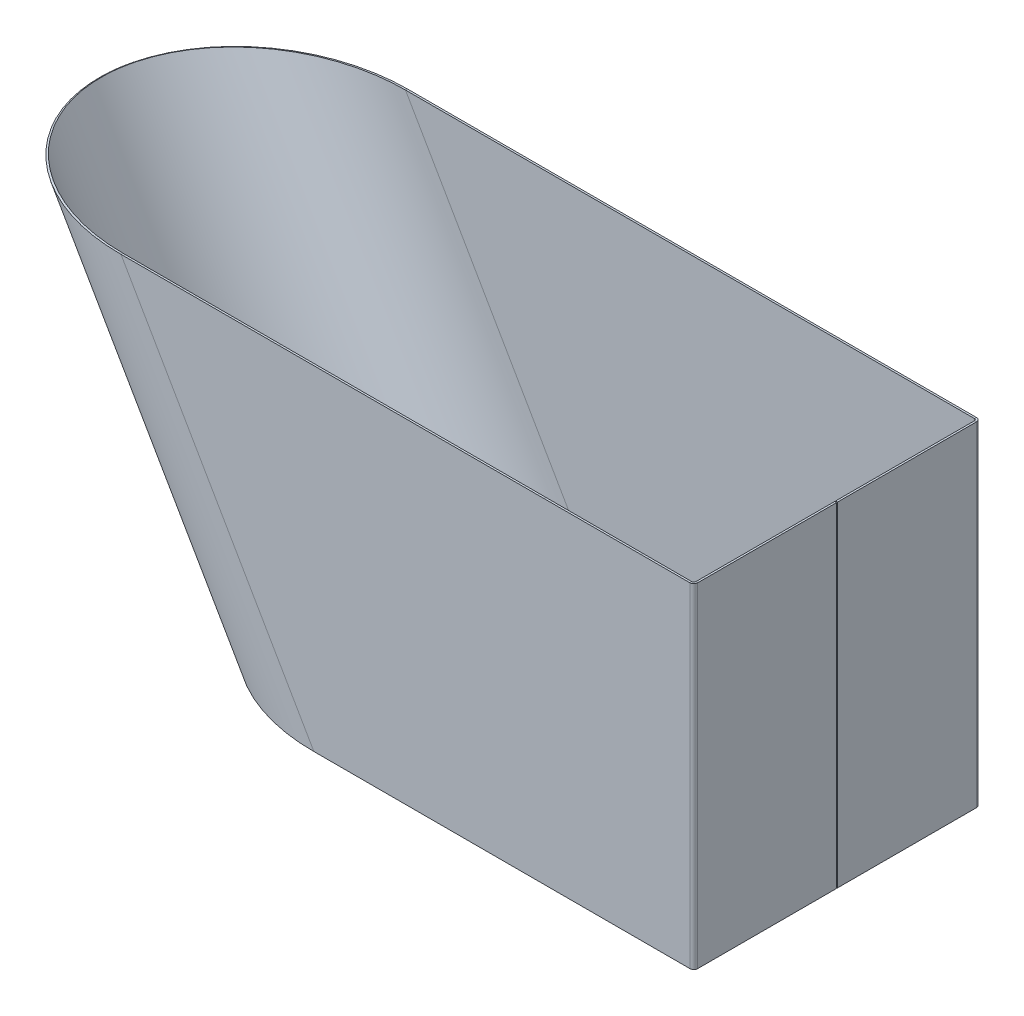
ISO-10303-21;
HEADER;
FILE_DESCRIPTION(('STEP AP214'),'2;1');
FILE_NAME('part.step','',(''),(''),'','','');
FILE_SCHEMA(('AUTOMOTIVE_DESIGN { 1 0 10303 214 1 1 1 1 }'));
ENDSEC;
DATA;
#1=APPLICATION_CONTEXT('core data for automotive mechanical design processes');
#2=APPLICATION_PROTOCOL_DEFINITION('international standard','automotive_design',2000,#1);
#3=PRODUCT_CONTEXT('',#1,'mechanical');
#4=PRODUCT('Part','Part','',(#3));
#5=PRODUCT_RELATED_PRODUCT_CATEGORY('part','',(#4));
#6=PRODUCT_DEFINITION_FORMATION('','',#4);
#7=PRODUCT_DEFINITION_CONTEXT('part definition',#1,'design');
#8=PRODUCT_DEFINITION('design','',#6,#7);
#9=PRODUCT_DEFINITION_SHAPE('','',#8);
#10=(LENGTH_UNIT() NAMED_UNIT(*) SI_UNIT(.MILLI.,.METRE.));
#11=(NAMED_UNIT(*) PLANE_ANGLE_UNIT() SI_UNIT($,.RADIAN.));
#12=(NAMED_UNIT(*) SI_UNIT($,.STERADIAN.) SOLID_ANGLE_UNIT());
#13=UNCERTAINTY_MEASURE_WITH_UNIT(LENGTH_MEASURE(1.E-05),#10,'distance_accuracy_value','');
#14=(GEOMETRIC_REPRESENTATION_CONTEXT(3) GLOBAL_UNCERTAINTY_ASSIGNED_CONTEXT((#13)) GLOBAL_UNIT_ASSIGNED_CONTEXT((#10,
#11,#12)) REPRESENTATION_CONTEXT('',''));
#15=CARTESIAN_POINT('',(0.,0.,0.));
#16=DIRECTION('',(0.,0.,1.));
#17=DIRECTION('',(1.,0.,0.));
#18=AXIS2_PLACEMENT_3D('',#15,#16,#17);
#19=CARTESIAN_POINT('',(397.927405783632,0.,148.));
#20=DIRECTION('',(0.,-1.,0.));
#21=DIRECTION('',(1.,0.,0.));
#22=AXIS2_PLACEMENT_3D('',#19,#20,#21);
#23=PLANE('',#22);
#24=DIRECTION('',(0.,0.,-1.));
#25=VECTOR('',#24,1.);
#26=CARTESIAN_POINT('',(393.927405783632,0.,148.));
#27=LINE('',#26,#25);
#28=CARTESIAN_POINT('',(393.927405783632,0.,150.));
#29=VERTEX_POINT('',#28);
#30=CARTESIAN_POINT('',(393.927405783632,0.,148.));
#31=VERTEX_POINT('',#30);
#32=EDGE_CURVE('E11',#29,#31,#27,.T.);
#33=ORIENTED_EDGE('',*,*,#32,.F.);
#34=DIRECTION('',(1.,0.,0.));
#35=VECTOR('',#34,1.);
#36=CARTESIAN_POINT('',(0.,0.,150.));
#37=LINE('',#36,#35);
#38=CARTESIAN_POINT('',(0.,0.,150.));
#39=VERTEX_POINT('',#38);
#40=EDGE_CURVE('E117',#39,#29,#37,.T.);
#41=ORIENTED_EDGE('',*,*,#40,.F.);
#42=DIRECTION('',(0.,0.,-1.));
#43=VECTOR('',#42,1.);
#44=CARTESIAN_POINT('',(0.,0.,148.));
#45=LINE('',#44,#43);
#46=CARTESIAN_POINT('',(0.,0.,148.));
#47=VERTEX_POINT('',#46);
#48=EDGE_CURVE('E53',#39,#47,#45,.T.);
#49=ORIENTED_EDGE('',*,*,#48,.T.);
#50=DIRECTION('',(1.,0.,0.));
#51=VECTOR('',#50,1.);
#52=CARTESIAN_POINT('',(397.927405783632,0.,148.));
#53=LINE('',#52,#51);
#54=EDGE_CURVE('E120',#47,#31,#53,.T.);
#55=ORIENTED_EDGE('',*,*,#54,.T.);
#56=EDGE_LOOP('',(#33,#41,#49,#55));
#57=FACE_BOUND('',#56,.T.);
#58=ADVANCED_FACE('F43',(#57),#23,.T.);
#59=CARTESIAN_POINT('',(-172.627730487698,-0.999999999999973,0.));
#60=CARTESIAN_POINT('',(-172.050380218508,-0.66666666666664,0.));
#61=CARTESIAN_POINT('',(-171.473029949319,-0.333333333333306,0.));
#62=CARTESIAN_POINT('',(-170.895679680129,0.,0.));
#63=CARTESIAN_POINT('',(-172.627730487698,-0.999999999999973,-300.));
#64=CARTESIAN_POINT('',(-172.050380218508,-0.66666666666664,-298.666666666667));
#65=CARTESIAN_POINT('',(-171.473029949319,-0.333333333333306,-297.333333333333));
#66=CARTESIAN_POINT('',(-170.895679680129,0.,-296.));
#67=CARTESIAN_POINT('',(172.627730487698,1.00000000000008,-300.));
#68=CARTESIAN_POINT('',(172.050380218508,0.666666666666751,-298.666666666667));
#69=CARTESIAN_POINT('',(171.473029949319,0.333333333333417,-297.333333333333));
#70=CARTESIAN_POINT('',(170.895679680129,0.,-296.));
#71=CARTESIAN_POINT('',(172.627730487698,1.00000000000008,0.));
#72=CARTESIAN_POINT('',(172.050380218508,0.666666666666751,0.));
#73=CARTESIAN_POINT('',(171.473029949319,0.333333333333417,0.));
#74=CARTESIAN_POINT('',(170.895679680129,0.,0.));
#75=CARTESIAN_POINT('',(172.627730487698,1.00000000000008,300.));
#76=CARTESIAN_POINT('',(172.050380218508,0.666666666666751,298.666666666667));
#77=CARTESIAN_POINT('',(171.473029949319,0.333333333333417,297.333333333333));
#78=CARTESIAN_POINT('',(170.895679680129,0.,296.));
#79=CARTESIAN_POINT('',(-172.627730487698,-0.999999999999973,300.));
#80=CARTESIAN_POINT('',(-172.050380218508,-0.66666666666664,298.666666666667));
#81=CARTESIAN_POINT('',(-171.473029949319,-0.333333333333306,297.333333333333));
#82=CARTESIAN_POINT('',(-170.895679680129,0.,296.));
#83=CARTESIAN_POINT('',(-172.627730487698,-0.999999999999973,0.));
#84=CARTESIAN_POINT('',(-172.050380218508,-0.66666666666664,0.));
#85=CARTESIAN_POINT('',(-171.473029949319,-0.333333333333306,0.));
#86=CARTESIAN_POINT('',(-170.895679680129,0.,0.));
#87=(BOUNDED_SURFACE() B_SPLINE_SURFACE(3,3,((#59,#60,#61,#62),(#63,#64,#65,#66),(#67,#68,#69,
#70),(#71,#72,#73,#74),(#75,#76,#77,#78),(#79,#80,#81,#82),(#83,#84,#85,#86)),.UNSPECIFIED.,.T.,
.F.,.F.) B_SPLINE_SURFACE_WITH_KNOTS((4,3,4),(4,4),(0.,0.5,1.),(0.,1.),
.UNSPECIFIED.) GEOMETRIC_REPRESENTATION_ITEM() RATIONAL_B_SPLINE_SURFACE(((1.,1.,1.,1.),
(0.333333333333333,0.333333333333333,0.333333333333333,0.333333333333333),(0.333333333333333,
0.333333333333333,0.333333333333333,0.333333333333333),(1.,1.,1.,1.),(0.333333333333333,
0.333333333333333,0.333333333333333,0.333333333333333),(0.333333333333333,0.333333333333333,
0.333333333333333,0.333333333333333),(1.,1.,1.,1.))) REPRESENTATION_ITEM('') SURFACE());
#88=CARTESIAN_POINT('',(0.,0.,0.));
#89=DIRECTION('',(-0.00579271487414784,0.999983222086444,0.));
#90=DIRECTION('',(-0.999983222086444,-0.00579271487414784,0.));
#91=AXIS2_PLACEMENT_3D('',#88,#89,#90);
#92=ELLIPSE('',#91,172.630626869433,150.);
#93=CARTESIAN_POINT('',(0.,0.,-150.));
#94=VERTEX_POINT('',#93);
#95=EDGE_CURVE('E283',#39,#94,#92,.F.);
#96=DIRECTION('',(0.,0.,1.));
#97=VECTOR('',#96,1.);
#98=CARTESIAN_POINT('',(-1.11022302462516E-13,0.,-148.));
#99=LINE('',#98,#97);
#100=CARTESIAN_POINT('',(-1.11022302462516E-13,0.,-148.));
#101=VERTEX_POINT('',#100);
#102=EDGE_CURVE('E195',#94,#101,#99,.T.);
#103=CARTESIAN_POINT('',(0.,0.,0.));
#104=DIRECTION('',(0.,1.,0.));
#105=DIRECTION('',(-1.,0.,0.));
#106=AXIS2_PLACEMENT_3D('',#103,#104,#105);
#107=ELLIPSE('',#106,170.895679680129,148.);
#108=EDGE_CURVE('E216',#47,#101,#107,.F.);
#109=ORIENTED_EDGE('',*,*,#48,.F.);
#110=ORIENTED_EDGE('',*,*,#95,.T.);
#111=ORIENTED_EDGE('',*,*,#102,.T.);
#112=ORIENTED_EDGE('',*,*,#108,.F.);
#113=EDGE_LOOP('',(#109,#110,#111,#112));
#114=FACE_BOUND('',#113,.T.);
#115=ADVANCED_FACE('F217',(#114),#87,.T.);
#116=CARTESIAN_POINT('',(397.927405783632,0.,-148.));
#117=DIRECTION('',(0.,-1.,0.));
#118=DIRECTION('',(1.,0.,0.));
#119=AXIS2_PLACEMENT_3D('',#116,#117,#118);
#120=PLANE('',#119);
#121=ORIENTED_EDGE('',*,*,#102,.F.);
#122=DIRECTION('',(1.,0.,0.));
#123=VECTOR('',#122,1.);
#124=CARTESIAN_POINT('',(0.,0.,-150.));
#125=LINE('',#124,#123);
#126=CARTESIAN_POINT('',(393.927405783632,0.,-150.));
#127=VERTEX_POINT('',#126);
#128=EDGE_CURVE('E153',#94,#127,#125,.T.);
#129=ORIENTED_EDGE('',*,*,#128,.T.);
#130=DIRECTION('',(0.,0.,1.));
#131=VECTOR('',#130,1.);
#132=CARTESIAN_POINT('',(393.927405783632,0.,-148.));
#133=LINE('',#132,#131);
#134=CARTESIAN_POINT('',(393.927405783632,0.,-148.));
#135=VERTEX_POINT('',#134);
#136=EDGE_CURVE('E192',#127,#135,#133,.T.);
#137=ORIENTED_EDGE('',*,*,#136,.T.);
#138=DIRECTION('',(1.,0.,0.));
#139=VECTOR('',#138,1.);
#140=CARTESIAN_POINT('',(397.927405783632,0.,-148.));
#141=LINE('',#140,#139);
#142=EDGE_CURVE('E250',#101,#135,#141,.T.);
#143=ORIENTED_EDGE('',*,*,#142,.F.);
#144=EDGE_LOOP('',(#121,#129,#137,#143));
#145=FACE_BOUND('',#144,.T.);
#146=ADVANCED_FACE('F309',(#145),#120,.T.);
#147=CARTESIAN_POINT('',(393.927405783632,0.,-146.));
#148=DIRECTION('',(0.,1.,0.));
#149=DIRECTION('',(-1.,0.,0.));
#150=AXIS2_PLACEMENT_3D('',#147,#148,#149);
#151=PLANE('',#150);
#152=ORIENTED_EDGE('',*,*,#136,.F.);
#153=CARTESIAN_POINT('',(393.927405783632,0.,-146.));
#154=DIRECTION('',(0.,-1.,0.));
#155=DIRECTION('',(1.,0.,0.));
#156=AXIS2_PLACEMENT_3D('',#153,#154,#155);
#157=CIRCLE('',#156,4.);
#158=CARTESIAN_POINT('',(397.927405783632,0.,-146.));
#159=VERTEX_POINT('',#158);
#160=EDGE_CURVE('E158',#127,#159,#157,.T.);
#161=ORIENTED_EDGE('',*,*,#160,.T.);
#162=DIRECTION('',(-1.,0.,0.));
#163=VECTOR('',#162,1.);
#164=CARTESIAN_POINT('',(395.927405783632,0.,-146.));
#165=LINE('',#164,#163);
#166=CARTESIAN_POINT('',(395.927405783632,0.,-146.));
#167=VERTEX_POINT('',#166);
#168=EDGE_CURVE('E61',#159,#167,#165,.T.);
#169=ORIENTED_EDGE('',*,*,#168,.T.);
#170=CARTESIAN_POINT('',(393.927405783632,0.,-146.));
#171=DIRECTION('',(0.,-1.,0.));
#172=DIRECTION('',(1.,0.,0.));
#173=AXIS2_PLACEMENT_3D('',#170,#171,#172);
#174=CIRCLE('',#173,2.);
#175=EDGE_CURVE('E248',#135,#167,#174,.T.);
#176=ORIENTED_EDGE('',*,*,#175,.F.);
#177=EDGE_LOOP('',(#152,#161,#169,#176));
#178=FACE_BOUND('',#177,.T.);
#179=ADVANCED_FACE('F402',(#178),#151,.F.);
#180=CARTESIAN_POINT('',(395.927405783632,0.,150.));
#181=DIRECTION('',(0.,1.,0.));
#182=DIRECTION('',(0.,0.,-1.));
#183=AXIS2_PLACEMENT_3D('',#180,#181,#182);
#184=PLANE('',#183);
#185=ORIENTED_EDGE('',*,*,#168,.F.);
#186=DIRECTION('',(0.,0.,1.));
#187=VECTOR('',#186,1.);
#188=CARTESIAN_POINT('',(397.927405783632,4.44089209850063E-13,150.));
#189=LINE('',#188,#187);
#190=CARTESIAN_POINT('',(397.927405783632,4.44089209850063E-13,-0.5));
#191=VERTEX_POINT('',#190);
#192=EDGE_CURVE('E148',#191,#159,#189,.F.);
#193=ORIENTED_EDGE('',*,*,#192,.F.);
#194=DIRECTION('',(-1.,0.,0.));
#195=VECTOR('',#194,1.);
#196=CARTESIAN_POINT('',(395.927405783632,4.4679465673982E-13,-0.499999999999994));
#197=LINE('',#196,#195);
#198=CARTESIAN_POINT('',(395.927405783632,4.4679465673982E-13,-0.499999999999994));
#199=VERTEX_POINT('',#198);
#200=EDGE_CURVE('E188',#191,#199,#197,.T.);
#201=ORIENTED_EDGE('',*,*,#200,.T.);
#202=DIRECTION('',(0.,0.,-1.));
#203=VECTOR('',#202,1.);
#204=CARTESIAN_POINT('',(395.927405783632,0.,150.));
#205=LINE('',#204,#203);
#206=EDGE_CURVE('E213',#199,#167,#205,.T.);
#207=ORIENTED_EDGE('',*,*,#206,.T.);
#208=EDGE_LOOP('',(#185,#193,#201,#207));
#209=FACE_BOUND('',#208,.T.);
#210=ADVANCED_FACE('F405',(#209),#184,.F.);
#211=CARTESIAN_POINT('',(395.927405783632,4.4679465673982E-13,-0.499999999999994));
#212=DIRECTION('',(0.,0.,1.));
#213=DIRECTION('',(0.,1.,0.));
#214=AXIS2_PLACEMENT_3D('',#211,#212,#213);
#215=PLANE('',#214);
#216=ORIENTED_EDGE('',*,*,#200,.F.);
#217=DIRECTION('',(0.,-1.,0.));
#218=VECTOR('',#217,1.);
#219=CARTESIAN_POINT('',(397.927405783632,350.,-0.5));
#220=LINE('',#219,#218);
#221=CARTESIAN_POINT('',(397.927405783632,350.,-0.5));
#222=VERTEX_POINT('',#221);
#223=EDGE_CURVE('E268',#191,#222,#220,.F.);
#224=ORIENTED_EDGE('',*,*,#223,.T.);
#225=DIRECTION('',(-1.,0.,0.));
#226=VECTOR('',#225,1.);
#227=CARTESIAN_POINT('',(395.927405783632,350.,-0.5));
#228=LINE('',#227,#226);
#229=CARTESIAN_POINT('',(395.927405783632,350.,-0.5));
#230=VERTEX_POINT('',#229);
#231=EDGE_CURVE('E185',#222,#230,#228,.T.);
#232=ORIENTED_EDGE('',*,*,#231,.T.);
#233=DIRECTION('',(0.,1.,0.));
#234=VECTOR('',#233,1.);
#235=CARTESIAN_POINT('',(395.927405783632,4.4679465673982E-13,-0.499999999999994));
#236=LINE('',#235,#234);
#237=EDGE_CURVE('E322',#199,#230,#236,.T.);
#238=ORIENTED_EDGE('',*,*,#237,.F.);
#239=EDGE_LOOP('',(#216,#224,#232,#238));
#240=FACE_BOUND('',#239,.T.);
#241=ADVANCED_FACE('F406',(#240),#215,.T.);
#242=CARTESIAN_POINT('',(395.927405783632,350.,150.));
#243=DIRECTION('',(0.,1.,0.));
#244=DIRECTION('',(0.,0.,-1.));
#245=AXIS2_PLACEMENT_3D('',#242,#243,#244);
#246=PLANE('',#245);
#247=ORIENTED_EDGE('',*,*,#231,.F.);
#248=DIRECTION('',(0.,0.,1.));
#249=VECTOR('',#248,1.);
#250=CARTESIAN_POINT('',(397.927405783632,350.,150.));
#251=LINE('',#250,#249);
#252=CARTESIAN_POINT('',(397.927405783632,350.,-146.));
#253=VERTEX_POINT('',#252);
#254=EDGE_CURVE('E291',#222,#253,#251,.F.);
#255=ORIENTED_EDGE('',*,*,#254,.T.);
#256=DIRECTION('',(-1.,0.,0.));
#257=VECTOR('',#256,1.);
#258=CARTESIAN_POINT('',(395.927405783632,350.,-146.));
#259=LINE('',#258,#257);
#260=CARTESIAN_POINT('',(395.927405783632,350.,-146.));
#261=VERTEX_POINT('',#260);
#262=EDGE_CURVE('E183',#253,#261,#259,.T.);
#263=ORIENTED_EDGE('',*,*,#262,.T.);
#264=DIRECTION('',(0.,0.,-1.));
#265=VECTOR('',#264,1.);
#266=CARTESIAN_POINT('',(395.927405783632,350.,150.));
#267=LINE('',#266,#265);
#268=EDGE_CURVE('E325',#230,#261,#267,.T.);
#269=ORIENTED_EDGE('',*,*,#268,.F.);
#270=EDGE_LOOP('',(#247,#255,#263,#269));
#271=FACE_BOUND('',#270,.T.);
#272=ADVANCED_FACE('F409',(#271),#246,.T.);
#273=CARTESIAN_POINT('',(393.927405783632,350.,-146.));
#274=DIRECTION('',(0.,1.,0.));
#275=DIRECTION('',(0.,0.,1.));
#276=AXIS2_PLACEMENT_3D('',#273,#274,#275);
#277=PLANE('',#276);
#278=ORIENTED_EDGE('',*,*,#262,.F.);
#279=CARTESIAN_POINT('',(393.927405783632,350.,-146.));
#280=DIRECTION('',(0.,-1.,0.));
#281=DIRECTION('',(1.,0.,0.));
#282=AXIS2_PLACEMENT_3D('',#279,#280,#281);
#283=CIRCLE('',#282,4.);
#284=CARTESIAN_POINT('',(393.927405783632,350.,-150.));
#285=VERTEX_POINT('',#284);
#286=EDGE_CURVE('E288',#253,#285,#283,.F.);
#287=ORIENTED_EDGE('',*,*,#286,.T.);
#288=DIRECTION('',(0.,0.,1.));
#289=VECTOR('',#288,1.);
#290=CARTESIAN_POINT('',(393.927405783632,350.,-148.));
#291=LINE('',#290,#289);
#292=CARTESIAN_POINT('',(393.927405783632,350.,-148.));
#293=VERTEX_POINT('',#292);
#294=EDGE_CURVE('E180',#285,#293,#291,.T.);
#295=ORIENTED_EDGE('',*,*,#294,.T.);
#296=CARTESIAN_POINT('',(393.927405783632,350.,-146.));
#297=DIRECTION('',(0.,-1.,0.));
#298=DIRECTION('',(0.,0.,-1.));
#299=AXIS2_PLACEMENT_3D('',#296,#297,#298);
#300=CIRCLE('',#299,2.);
#301=EDGE_CURVE('E256',#261,#293,#300,.F.);
#302=ORIENTED_EDGE('',*,*,#301,.F.);
#303=EDGE_LOOP('',(#278,#287,#295,#302));
#304=FACE_BOUND('',#303,.T.);
#305=ADVANCED_FACE('F359',(#304),#277,.T.);
#306=CARTESIAN_POINT('',(-202.072594216368,350.,-148.));
#307=DIRECTION('',(0.,1.,0.));
#308=DIRECTION('',(-1.,0.,0.));
#309=AXIS2_PLACEMENT_3D('',#306,#307,#308);
#310=PLANE('',#309);
#311=ORIENTED_EDGE('',*,*,#294,.F.);
#312=DIRECTION('',(1.,0.,0.));
#313=VECTOR('',#312,1.);
#314=CARTESIAN_POINT('',(0.,350.,-150.));
#315=LINE('',#314,#313);
#316=CARTESIAN_POINT('',(-202.072594216368,350.,-150.));
#317=VERTEX_POINT('',#316);
#318=EDGE_CURVE('E156',#285,#317,#315,.F.);
#319=ORIENTED_EDGE('',*,*,#318,.T.);
#320=DIRECTION('',(0.,0.,1.));
#321=VECTOR('',#320,1.);
#322=CARTESIAN_POINT('',(-202.072594216368,350.,-148.));
#323=LINE('',#322,#321);
#324=CARTESIAN_POINT('',(-202.072594216368,350.,-148.));
#325=VERTEX_POINT('',#324);
#326=EDGE_CURVE('E177',#317,#325,#323,.T.);
#327=ORIENTED_EDGE('',*,*,#326,.T.);
#328=DIRECTION('',(-1.,0.,0.));
#329=VECTOR('',#328,1.);
#330=CARTESIAN_POINT('',(-202.072594216368,350.,-148.));
#331=LINE('',#330,#329);
#332=EDGE_CURVE('E316',#293,#325,#331,.T.);
#333=ORIENTED_EDGE('',*,*,#332,.F.);
#334=EDGE_LOOP('',(#311,#319,#327,#333));
#335=FACE_BOUND('',#334,.T.);
#336=ADVANCED_FACE('F366',(#335),#310,.T.);
#337=CARTESIAN_POINT('',(-372.968273896497,350.,0.));
#338=CARTESIAN_POINT('',(-373.545624165687,349.666666666667,0.));
#339=CARTESIAN_POINT('',(-374.122974434876,349.333333333333,0.));
#340=CARTESIAN_POINT('',(-374.700324704066,349.,0.));
#341=CARTESIAN_POINT('',(-372.968273896497,350.,-296.));
#342=CARTESIAN_POINT('',(-373.545624165687,349.666666666667,-297.333333333333));
#343=CARTESIAN_POINT('',(-374.122974434876,349.333333333333,-298.666666666667));
#344=CARTESIAN_POINT('',(-374.700324704066,349.,-300.));
#345=CARTESIAN_POINT('',(-31.1769145362391,350.,-296.));
#346=CARTESIAN_POINT('',(-30.5995642670495,350.333333333333,-297.333333333333));
#347=CARTESIAN_POINT('',(-30.0222139978599,350.666666666667,-298.666666666667));
#348=CARTESIAN_POINT('',(-29.4448637286702,351.,-300.));
#349=CARTESIAN_POINT('',(-31.1769145362391,350.,0.));
#350=CARTESIAN_POINT('',(-30.5995642670494,350.333333333333,0.));
#351=CARTESIAN_POINT('',(-30.0222139978598,350.666666666667,0.));
#352=CARTESIAN_POINT('',(-29.4448637286702,351.,0.));
#353=CARTESIAN_POINT('',(-31.176914536239,350.,296.));
#354=CARTESIAN_POINT('',(-30.5995642670494,350.333333333333,297.333333333333));
#355=CARTESIAN_POINT('',(-30.0222139978598,350.666666666667,298.666666666667));
#356=CARTESIAN_POINT('',(-29.4448637286701,351.,300.));
#357=CARTESIAN_POINT('',(-372.968273896497,350.,296.));
#358=CARTESIAN_POINT('',(-373.545624165687,349.666666666667,297.333333333333));
#359=CARTESIAN_POINT('',(-374.122974434876,349.333333333333,298.666666666667));
#360=CARTESIAN_POINT('',(-374.700324704066,349.,300.));
#361=CARTESIAN_POINT('',(-372.968273896497,350.,0.));
#362=CARTESIAN_POINT('',(-373.545624165687,349.666666666667,0.));
#363=CARTESIAN_POINT('',(-374.122974434876,349.333333333333,0.));
#364=CARTESIAN_POINT('',(-374.700324704066,349.,0.));
#365=(BOUNDED_SURFACE() B_SPLINE_SURFACE(3,3,((#337,#338,#339,#340),(#341,#342,#343,#344),(#345,
#346,#347,#348),(#349,#350,#351,#352),(#353,#354,#355,#356),(#357,#358,#359,#360),(#361,#362,
#363,#364)),.UNSPECIFIED.,.T.,.F.,.F.) B_SPLINE_SURFACE_WITH_KNOTS((4,3,4),(4,4),(0.,0.5,1.),
(0.,1.),.UNSPECIFIED.) GEOMETRIC_REPRESENTATION_ITEM() RATIONAL_B_SPLINE_SURFACE(((1.,1.,1.,1.),
(0.333333333333333,0.333333333333333,0.333333333333333,0.333333333333333),(0.333333333333333,
0.333333333333333,0.333333333333333,0.333333333333333),(1.,1.,1.,1.),(0.333333333333333,
0.333333333333333,0.333333333333333,0.333333333333333),(0.333333333333333,0.333333333333333,
0.333333333333333,0.333333333333333),(1.,1.,1.,1.))) REPRESENTATION_ITEM('') SURFACE());
#366=CARTESIAN_POINT('',(-202.072594216368,350.,0.));
#367=DIRECTION('',(0.00579271487414768,-0.999983222086444,0.));
#368=DIRECTION('',(-0.999983222086444,-0.00579271487414768,0.));
#369=AXIS2_PLACEMENT_3D('',#366,#367,#368);
#370=ELLIPSE('',#369,172.630626869433,150.);
#371=CARTESIAN_POINT('',(-202.072594216368,350.,150.));
#372=VERTEX_POINT('',#371);
#373=EDGE_CURVE('E279',#372,#317,#370,.T.);
#374=DIRECTION('',(0.,0.,-1.));
#375=VECTOR('',#374,1.);
#376=CARTESIAN_POINT('',(-202.072594216368,350.,148.));
#377=LINE('',#376,#375);
#378=CARTESIAN_POINT('',(-202.072594216368,350.,148.));
#379=VERTEX_POINT('',#378);
#380=EDGE_CURVE('E174',#372,#379,#377,.T.);
#381=CARTESIAN_POINT('',(-202.072594216368,350.,0.));
#382=DIRECTION('',(0.,-1.,0.));
#383=DIRECTION('',(-1.,0.,0.));
#384=AXIS2_PLACEMENT_3D('',#381,#382,#383);
#385=ELLIPSE('',#384,170.895679680129,148.);
#386=EDGE_CURVE('E222',#379,#325,#385,.T.);
#387=ORIENTED_EDGE('',*,*,#326,.F.);
#388=ORIENTED_EDGE('',*,*,#373,.F.);
#389=ORIENTED_EDGE('',*,*,#380,.T.);
#390=ORIENTED_EDGE('',*,*,#386,.T.);
#391=EDGE_LOOP('',(#387,#388,#389,#390));
#392=FACE_BOUND('',#391,.T.);
#393=ADVANCED_FACE('F369',(#392),#365,.T.);
#394=CARTESIAN_POINT('',(-202.072594216368,350.,148.));
#395=DIRECTION('',(0.,1.,0.));
#396=DIRECTION('',(-1.,0.,0.));
#397=AXIS2_PLACEMENT_3D('',#394,#395,#396);
#398=PLANE('',#397);
#399=ORIENTED_EDGE('',*,*,#380,.F.);
#400=DIRECTION('',(1.,0.,0.));
#401=VECTOR('',#400,1.);
#402=CARTESIAN_POINT('',(0.,350.,150.));
#403=LINE('',#402,#401);
#404=CARTESIAN_POINT('',(393.927405783632,350.,150.));
#405=VERTEX_POINT('',#404);
#406=EDGE_CURVE('E264',#405,#372,#403,.F.);
#407=ORIENTED_EDGE('',*,*,#406,.F.);
#408=DIRECTION('',(0.,0.,-1.));
#409=VECTOR('',#408,1.);
#410=CARTESIAN_POINT('',(393.927405783632,350.,148.));
#411=LINE('',#410,#409);
#412=CARTESIAN_POINT('',(393.927405783632,350.,148.));
#413=VERTEX_POINT('',#412);
#414=EDGE_CURVE('E171',#405,#413,#411,.T.);
#415=ORIENTED_EDGE('',*,*,#414,.T.);
#416=DIRECTION('',(-1.,0.,0.));
#417=VECTOR('',#416,1.);
#418=CARTESIAN_POINT('',(-202.072594216368,350.,148.));
#419=LINE('',#418,#417);
#420=EDGE_CURVE('E223',#413,#379,#419,.T.);
#421=ORIENTED_EDGE('',*,*,#420,.T.);
#422=EDGE_LOOP('',(#399,#407,#415,#421));
#423=FACE_BOUND('',#422,.T.);
#424=ADVANCED_FACE('F372',(#423),#398,.T.);
#425=CARTESIAN_POINT('',(393.927405783632,350.,146.));
#426=DIRECTION('',(0.,-1.,0.));
#427=DIRECTION('',(0.,0.,-1.));
#428=AXIS2_PLACEMENT_3D('',#425,#426,#427);
#429=PLANE('',#428);
#430=ORIENTED_EDGE('',*,*,#414,.F.);
#431=CARTESIAN_POINT('',(393.927405783632,350.,146.));
#432=DIRECTION('',(0.,1.,0.));
#433=DIRECTION('',(-1.,0.,0.));
#434=AXIS2_PLACEMENT_3D('',#431,#432,#433);
#435=CIRCLE('',#434,4.);
#436=CARTESIAN_POINT('',(397.927405783632,350.,146.));
#437=VERTEX_POINT('',#436);
#438=EDGE_CURVE('E136',#405,#437,#435,.T.);
#439=ORIENTED_EDGE('',*,*,#438,.T.);
#440=DIRECTION('',(-1.,0.,0.));
#441=VECTOR('',#440,1.);
#442=CARTESIAN_POINT('',(395.927405783632,350.,146.));
#443=LINE('',#442,#441);
#444=CARTESIAN_POINT('',(395.927405783632,350.,146.));
#445=VERTEX_POINT('',#444);
#446=EDGE_CURVE('E168',#437,#445,#443,.T.);
#447=ORIENTED_EDGE('',*,*,#446,.T.);
#448=CARTESIAN_POINT('',(393.927405783632,350.,146.));
#449=DIRECTION('',(0.,1.,0.));
#450=DIRECTION('',(0.,0.,1.));
#451=AXIS2_PLACEMENT_3D('',#448,#449,#450);
#452=CIRCLE('',#451,2.);
#453=EDGE_CURVE('E244',#413,#445,#452,.T.);
#454=ORIENTED_EDGE('',*,*,#453,.F.);
#455=EDGE_LOOP('',(#430,#439,#447,#454));
#456=FACE_BOUND('',#455,.T.);
#457=ADVANCED_FACE('F373',(#456),#429,.F.);
#458=ORIENTED_EDGE('',*,*,#446,.F.);
#459=DIRECTION('',(0.,0.,1.));
#460=VECTOR('',#459,1.);
#461=CARTESIAN_POINT('',(397.927405783632,350.,150.));
#462=LINE('',#461,#460);
#463=CARTESIAN_POINT('',(397.927405783632,350.,0.5));
#464=VERTEX_POINT('',#463);
#465=EDGE_CURVE('E261',#437,#464,#462,.F.);
#466=ORIENTED_EDGE('',*,*,#465,.T.);
#467=DIRECTION('',(-1.,0.,0.));
#468=VECTOR('',#467,1.);
#469=CARTESIAN_POINT('',(395.927405783632,350.,0.500000000000004));
#470=LINE('',#469,#468);
#471=CARTESIAN_POINT('',(395.927405783632,350.,0.500000000000004));
#472=VERTEX_POINT('',#471);
#473=EDGE_CURVE('E165',#464,#472,#470,.T.);
#474=ORIENTED_EDGE('',*,*,#473,.T.);
#475=EDGE_CURVE('E241',#445,#472,#267,.T.);
#476=ORIENTED_EDGE('',*,*,#475,.F.);
#477=EDGE_LOOP('',(#458,#466,#474,#476));
#478=FACE_BOUND('',#477,.T.);
#479=ADVANCED_FACE('F348',(#478),#246,.T.);
#480=CARTESIAN_POINT('',(395.927405783632,4.3545119151019E-13,0.499999999999997));
#481=DIRECTION('',(0.,0.,-1.));
#482=DIRECTION('',(0.,-1.,0.));
#483=AXIS2_PLACEMENT_3D('',#480,#481,#482);
#484=PLANE('',#483);
#485=ORIENTED_EDGE('',*,*,#473,.F.);
#486=DIRECTION('',(0.,-1.,0.));
#487=VECTOR('',#486,1.);
#488=CARTESIAN_POINT('',(397.927405783632,350.,0.5));
#489=LINE('',#488,#487);
#490=CARTESIAN_POINT('',(397.927405783632,0.,0.5));
#491=VERTEX_POINT('',#490);
#492=EDGE_CURVE('E276',#464,#491,#489,.T.);
#493=ORIENTED_EDGE('',*,*,#492,.T.);
#494=DIRECTION('',(-1.,0.,0.));
#495=VECTOR('',#494,1.);
#496=CARTESIAN_POINT('',(395.927405783632,0.,0.5));
#497=LINE('',#496,#495);
#498=CARTESIAN_POINT('',(395.927405783632,0.,0.5));
#499=VERTEX_POINT('',#498);
#500=EDGE_CURVE('E162',#491,#499,#497,.T.);
#501=ORIENTED_EDGE('',*,*,#500,.T.);
#502=DIRECTION('',(0.,-1.,0.));
#503=VECTOR('',#502,1.);
#504=CARTESIAN_POINT('',(395.927405783632,4.3545119151019E-13,0.499999999999997));
#505=LINE('',#504,#503);
#506=EDGE_CURVE('E234',#472,#499,#505,.T.);
#507=ORIENTED_EDGE('',*,*,#506,.F.);
#508=EDGE_LOOP('',(#485,#493,#501,#507));
#509=FACE_BOUND('',#508,.T.);
#510=ADVANCED_FACE('F430',(#509),#484,.T.);
#511=ORIENTED_EDGE('',*,*,#500,.F.);
#512=DIRECTION('',(0.,0.,1.));
#513=VECTOR('',#512,1.);
#514=CARTESIAN_POINT('',(397.927405783632,0.,150.));
#515=LINE('',#514,#513);
#516=CARTESIAN_POINT('',(397.927405783632,0.,146.));
#517=VERTEX_POINT('',#516);
#518=EDGE_CURVE('E273',#517,#491,#515,.F.);
#519=ORIENTED_EDGE('',*,*,#518,.F.);
#520=DIRECTION('',(-1.,0.,0.));
#521=VECTOR('',#520,1.);
#522=CARTESIAN_POINT('',(395.927405783632,0.,146.));
#523=LINE('',#522,#521);
#524=CARTESIAN_POINT('',(395.927405783632,0.,146.));
#525=VERTEX_POINT('',#524);
#526=EDGE_CURVE('E47',#517,#525,#523,.T.);
#527=ORIENTED_EDGE('',*,*,#526,.T.);
#528=EDGE_CURVE('E237',#525,#499,#205,.T.);
#529=ORIENTED_EDGE('',*,*,#528,.T.);
#530=EDGE_LOOP('',(#511,#519,#527,#529));
#531=FACE_BOUND('',#530,.T.);
#532=ADVANCED_FACE('F433',(#531),#184,.F.);
#533=CARTESIAN_POINT('',(393.927405783632,0.,146.));
#534=DIRECTION('',(0.,-1.,0.));
#535=DIRECTION('',(1.,0.,0.));
#536=AXIS2_PLACEMENT_3D('',#533,#534,#535);
#537=PLANE('',#536);
#538=CARTESIAN_POINT('',(393.927405783632,0.,146.));
#539=DIRECTION('',(0.,1.,0.));
#540=DIRECTION('',(-1.,0.,0.));
#541=AXIS2_PLACEMENT_3D('',#538,#539,#540);
#542=CIRCLE('',#541,4.);
#543=EDGE_CURVE('E133',#517,#29,#542,.F.);
#544=ORIENTED_EDGE('',*,*,#543,.T.);
#545=ORIENTED_EDGE('',*,*,#32,.T.);
#546=CARTESIAN_POINT('',(393.927405783632,0.,146.));
#547=DIRECTION('',(0.,1.,0.));
#548=DIRECTION('',(-1.,0.,0.));
#549=AXIS2_PLACEMENT_3D('',#546,#547,#548);
#550=CIRCLE('',#549,2.);
#551=EDGE_CURVE('E247',#525,#31,#550,.F.);
#552=ORIENTED_EDGE('',*,*,#551,.F.);
#553=ORIENTED_EDGE('',*,*,#526,.F.);
#554=EDGE_LOOP('',(#544,#545,#552,#553));
#555=FACE_BOUND('',#554,.T.);
#556=ADVANCED_FACE('F45',(#555),#537,.T.);
#557=CARTESIAN_POINT('',(395.927405783632,350.,150.));
#558=DIRECTION('',(-1.,0.,0.));
#559=DIRECTION('',(0.,-1.,0.));
#560=AXIS2_PLACEMENT_3D('',#557,#558,#559);
#561=PLANE('',#560);
#562=ORIENTED_EDGE('',*,*,#528,.F.);
#563=DIRECTION('',(0.,1.,0.));
#564=VECTOR('',#563,1.);
#565=CARTESIAN_POINT('',(395.927405783632,350.,146.));
#566=LINE('',#565,#564);
#567=EDGE_CURVE('E238',#525,#445,#566,.T.);
#568=ORIENTED_EDGE('',*,*,#567,.T.);
#569=ORIENTED_EDGE('',*,*,#475,.T.);
#570=ORIENTED_EDGE('',*,*,#506,.T.);
#571=EDGE_LOOP('',(#562,#568,#569,#570));
#572=FACE_BOUND('',#571,.T.);
#573=ADVANCED_FACE('F341',(#572),#561,.T.);
#574=CARTESIAN_POINT('',(159.026497716816,-275.441973795263,0.));
#575=DIRECTION('',(-0.499999999999998,0.86602540378444,0.));
#576=DIRECTION('',(-0.86602540378444,-0.499999999999998,0.));
#577=AXIS2_PLACEMENT_3D('',#574,#575,#576);
#578=CYLINDRICAL_SURFACE('',#577,148.);
#579=ORIENTED_EDGE('',*,*,#108,.T.);
#580=DIRECTION('',(-0.499999999999998,0.86602540378444,0.));
#581=VECTOR('',#580,1.);
#582=CARTESIAN_POINT('',(159.026497716816,-275.441973795263,-148.));
#583=LINE('',#582,#581);
#584=EDGE_CURVE('E319',#325,#101,#583,.F.);
#585=ORIENTED_EDGE('',*,*,#584,.F.);
#586=ORIENTED_EDGE('',*,*,#386,.F.);
#587=DIRECTION('',(-0.499999999999998,0.86602540378444,0.));
#588=VECTOR('',#587,1.);
#589=CARTESIAN_POINT('',(159.026497716816,-275.441973795263,148.));
#590=LINE('',#589,#588);
#591=EDGE_CURVE('E210',#379,#47,#590,.F.);
#592=ORIENTED_EDGE('',*,*,#591,.T.);
#593=EDGE_LOOP('',(#579,#585,#586,#592));
#594=FACE_BOUND('',#593,.T.);
#595=ADVANCED_FACE('F226',(#594),#578,.F.);
#596=CARTESIAN_POINT('',(0.,0.,148.));
#597=DIRECTION('',(0.,0.,1.));
#598=DIRECTION('',(1.,0.,0.));
#599=AXIS2_PLACEMENT_3D('',#596,#597,#598);
#600=PLANE('',#599);
#601=ORIENTED_EDGE('',*,*,#420,.F.);
#602=DIRECTION('',(0.,1.,0.));
#603=VECTOR('',#602,1.);
#604=CARTESIAN_POINT('',(393.927405783632,2.49912729103912E-13,148.));
#605=LINE('',#604,#603);
#606=EDGE_CURVE('E212',#413,#31,#605,.F.);
#607=ORIENTED_EDGE('',*,*,#606,.T.);
#608=ORIENTED_EDGE('',*,*,#54,.F.);
#609=ORIENTED_EDGE('',*,*,#591,.F.);
#610=EDGE_LOOP('',(#601,#607,#608,#609));
#611=FACE_BOUND('',#610,.T.);
#612=ADVANCED_FACE('F208',(#611),#600,.F.);
#613=ORIENTED_EDGE('',*,*,#268,.T.);
#614=DIRECTION('',(0.,1.,0.));
#615=VECTOR('',#614,1.);
#616=CARTESIAN_POINT('',(395.927405783632,0.,-146.));
#617=LINE('',#616,#615);
#618=EDGE_CURVE('E253',#261,#167,#617,.F.);
#619=ORIENTED_EDGE('',*,*,#618,.T.);
#620=ORIENTED_EDGE('',*,*,#206,.F.);
#621=ORIENTED_EDGE('',*,*,#237,.T.);
#622=EDGE_LOOP('',(#613,#619,#620,#621));
#623=FACE_BOUND('',#622,.T.);
#624=ADVANCED_FACE('F384',(#623),#561,.T.);
#625=CARTESIAN_POINT('',(0.,0.,-148.));
#626=DIRECTION('',(0.,0.,1.));
#627=DIRECTION('',(1.,0.,0.));
#628=AXIS2_PLACEMENT_3D('',#625,#626,#627);
#629=PLANE('',#628);
#630=ORIENTED_EDGE('',*,*,#142,.T.);
#631=DIRECTION('',(0.,1.,0.));
#632=VECTOR('',#631,1.);
#633=CARTESIAN_POINT('',(393.927405783632,350.,-148.));
#634=LINE('',#633,#632);
#635=EDGE_CURVE('E243',#135,#293,#634,.T.);
#636=ORIENTED_EDGE('',*,*,#635,.T.);
#637=ORIENTED_EDGE('',*,*,#332,.T.);
#638=ORIENTED_EDGE('',*,*,#584,.T.);
#639=EDGE_LOOP('',(#630,#636,#637,#638));
#640=FACE_BOUND('',#639,.T.);
#641=ADVANCED_FACE('F320',(#640),#629,.T.);
#642=CARTESIAN_POINT('',(393.927405783632,350.,146.));
#643=DIRECTION('',(0.,1.,0.));
#644=DIRECTION('',(-1.,0.,0.));
#645=AXIS2_PLACEMENT_3D('',#642,#643,#644);
#646=CYLINDRICAL_SURFACE('',#645,2.);
#647=ORIENTED_EDGE('',*,*,#551,.T.);
#648=ORIENTED_EDGE('',*,*,#606,.F.);
#649=ORIENTED_EDGE('',*,*,#453,.T.);
#650=ORIENTED_EDGE('',*,*,#567,.F.);
#651=EDGE_LOOP('',(#647,#648,#649,#650));
#652=FACE_BOUND('',#651,.T.);
#653=ADVANCED_FACE('F375',(#652),#646,.F.);
#654=CARTESIAN_POINT('',(393.927405783632,2.49912729103912E-13,-146.));
#655=DIRECTION('',(0.,-1.,0.));
#656=DIRECTION('',(1.,0.,0.));
#657=AXIS2_PLACEMENT_3D('',#654,#655,#656);
#658=CYLINDRICAL_SURFACE('',#657,2.);
#659=ORIENTED_EDGE('',*,*,#175,.T.);
#660=ORIENTED_EDGE('',*,*,#618,.F.);
#661=ORIENTED_EDGE('',*,*,#301,.T.);
#662=ORIENTED_EDGE('',*,*,#635,.F.);
#663=EDGE_LOOP('',(#659,#660,#661,#662));
#664=FACE_BOUND('',#663,.T.);
#665=ADVANCED_FACE('F365',(#664),#658,.F.);
#666=CARTESIAN_POINT('',(397.927405783632,350.,150.));
#667=DIRECTION('',(-1.,0.,0.));
#668=DIRECTION('',(0.,-1.,0.));
#669=AXIS2_PLACEMENT_3D('',#666,#667,#668);
#670=PLANE('',#669);
#671=ORIENTED_EDGE('',*,*,#518,.T.);
#672=ORIENTED_EDGE('',*,*,#492,.F.);
#673=ORIENTED_EDGE('',*,*,#465,.F.);
#674=DIRECTION('',(0.,-1.,0.));
#675=VECTOR('',#674,1.);
#676=CARTESIAN_POINT('',(397.927405783632,350.,146.));
#677=LINE('',#676,#675);
#678=EDGE_CURVE('E141',#517,#437,#677,.F.);
#679=ORIENTED_EDGE('',*,*,#678,.F.);
#680=EDGE_LOOP('',(#671,#672,#673,#679));
#681=FACE_BOUND('',#680,.T.);
#682=ADVANCED_FACE('F382',(#681),#670,.F.);
#683=CARTESIAN_POINT('',(159.026497716816,-275.441973795263,0.));
#684=DIRECTION('',(-0.499999999999998,0.86602540378444,0.));
#685=DIRECTION('',(-0.86602540378444,-0.499999999999998,0.));
#686=AXIS2_PLACEMENT_3D('',#683,#684,#685);
#687=CYLINDRICAL_SURFACE('',#686,150.);
#688=ORIENTED_EDGE('',*,*,#95,.F.);
#689=DIRECTION('',(-0.499999999999998,0.86602540378444,0.));
#690=VECTOR('',#689,1.);
#691=CARTESIAN_POINT('',(159.026497716816,-275.441973795263,150.));
#692=LINE('',#691,#690);
#693=EDGE_CURVE('E146',#372,#39,#692,.F.);
#694=ORIENTED_EDGE('',*,*,#693,.F.);
#695=ORIENTED_EDGE('',*,*,#373,.T.);
#696=DIRECTION('',(-0.499999999999998,0.86602540378444,0.));
#697=VECTOR('',#696,1.);
#698=CARTESIAN_POINT('',(159.026497716816,-275.441973795263,-150.));
#699=LINE('',#698,#697);
#700=EDGE_CURVE('E265',#317,#94,#699,.F.);
#701=ORIENTED_EDGE('',*,*,#700,.T.);
#702=EDGE_LOOP('',(#688,#694,#695,#701));
#703=FACE_BOUND('',#702,.T.);
#704=ADVANCED_FACE('F299',(#703),#687,.T.);
#705=CARTESIAN_POINT('',(0.,0.,150.));
#706=DIRECTION('',(0.,0.,1.));
#707=DIRECTION('',(1.,0.,0.));
#708=AXIS2_PLACEMENT_3D('',#705,#706,#707);
#709=PLANE('',#708);
#710=ORIENTED_EDGE('',*,*,#406,.T.);
#711=ORIENTED_EDGE('',*,*,#693,.T.);
#712=ORIENTED_EDGE('',*,*,#40,.T.);
#713=DIRECTION('',(0.,1.,0.));
#714=VECTOR('',#713,1.);
#715=CARTESIAN_POINT('',(393.927405783632,0.,150.));
#716=LINE('',#715,#714);
#717=EDGE_CURVE('E130',#405,#29,#716,.F.);
#718=ORIENTED_EDGE('',*,*,#717,.F.);
#719=EDGE_LOOP('',(#710,#711,#712,#718));
#720=FACE_BOUND('',#719,.T.);
#721=ADVANCED_FACE('F144',(#720),#709,.T.);
#722=ORIENTED_EDGE('',*,*,#254,.F.);
#723=ORIENTED_EDGE('',*,*,#223,.F.);
#724=ORIENTED_EDGE('',*,*,#192,.T.);
#725=DIRECTION('',(0.,-1.,0.));
#726=VECTOR('',#725,1.);
#727=CARTESIAN_POINT('',(397.927405783632,350.,-146.));
#728=LINE('',#727,#726);
#729=EDGE_CURVE('E259',#253,#159,#728,.T.);
#730=ORIENTED_EDGE('',*,*,#729,.F.);
#731=EDGE_LOOP('',(#722,#723,#724,#730));
#732=FACE_BOUND('',#731,.T.);
#733=ADVANCED_FACE('F445',(#732),#670,.F.);
#734=CARTESIAN_POINT('',(0.,0.,-150.));
#735=DIRECTION('',(0.,0.,1.));
#736=DIRECTION('',(1.,0.,0.));
#737=AXIS2_PLACEMENT_3D('',#734,#735,#736);
#738=PLANE('',#737);
#739=ORIENTED_EDGE('',*,*,#128,.F.);
#740=ORIENTED_EDGE('',*,*,#700,.F.);
#741=ORIENTED_EDGE('',*,*,#318,.F.);
#742=DIRECTION('',(0.,1.,0.));
#743=VECTOR('',#742,1.);
#744=CARTESIAN_POINT('',(393.927405783632,0.,-150.));
#745=LINE('',#744,#743);
#746=EDGE_CURVE('E140',#127,#285,#745,.T.);
#747=ORIENTED_EDGE('',*,*,#746,.F.);
#748=EDGE_LOOP('',(#739,#740,#741,#747));
#749=FACE_BOUND('',#748,.T.);
#750=ADVANCED_FACE('F306',(#749),#738,.F.);
#751=CARTESIAN_POINT('',(393.927405783632,350.,146.));
#752=DIRECTION('',(0.,1.,0.));
#753=DIRECTION('',(-1.,0.,0.));
#754=AXIS2_PLACEMENT_3D('',#751,#752,#753);
#755=CYLINDRICAL_SURFACE('',#754,4.);
#756=ORIENTED_EDGE('',*,*,#543,.F.);
#757=ORIENTED_EDGE('',*,*,#678,.T.);
#758=ORIENTED_EDGE('',*,*,#438,.F.);
#759=ORIENTED_EDGE('',*,*,#717,.T.);
#760=EDGE_LOOP('',(#756,#757,#758,#759));
#761=FACE_BOUND('',#760,.T.);
#762=ADVANCED_FACE('F131',(#761),#755,.T.);
#763=CARTESIAN_POINT('',(393.927405783632,2.49912729103912E-13,-146.));
#764=DIRECTION('',(0.,-1.,0.));
#765=DIRECTION('',(1.,0.,0.));
#766=AXIS2_PLACEMENT_3D('',#763,#764,#765);
#767=CYLINDRICAL_SURFACE('',#766,4.);
#768=ORIENTED_EDGE('',*,*,#160,.F.);
#769=ORIENTED_EDGE('',*,*,#746,.T.);
#770=ORIENTED_EDGE('',*,*,#286,.F.);
#771=ORIENTED_EDGE('',*,*,#729,.T.);
#772=EDGE_LOOP('',(#768,#769,#770,#771));
#773=FACE_BOUND('',#772,.T.);
#774=ADVANCED_FACE('F437',(#773),#767,.T.);
#775=CLOSED_SHELL('',(#58,#115,#146,#179,#210,#241,#272,#305,#336,#393,#424,#457,#479,#510,#532,
#556,#573,#595,#612,#624,#641,#653,#665,#682,#704,#721,#733,#750,#762,#774));
#776=MANIFOLD_SOLID_BREP('B2',#775);
#777=ADVANCED_BREP_SHAPE_REPRESENTATION('',(#18,#776),#14);
#778=SHAPE_DEFINITION_REPRESENTATION(#9,#777);
ENDSEC;
END-ISO-10303-21;
